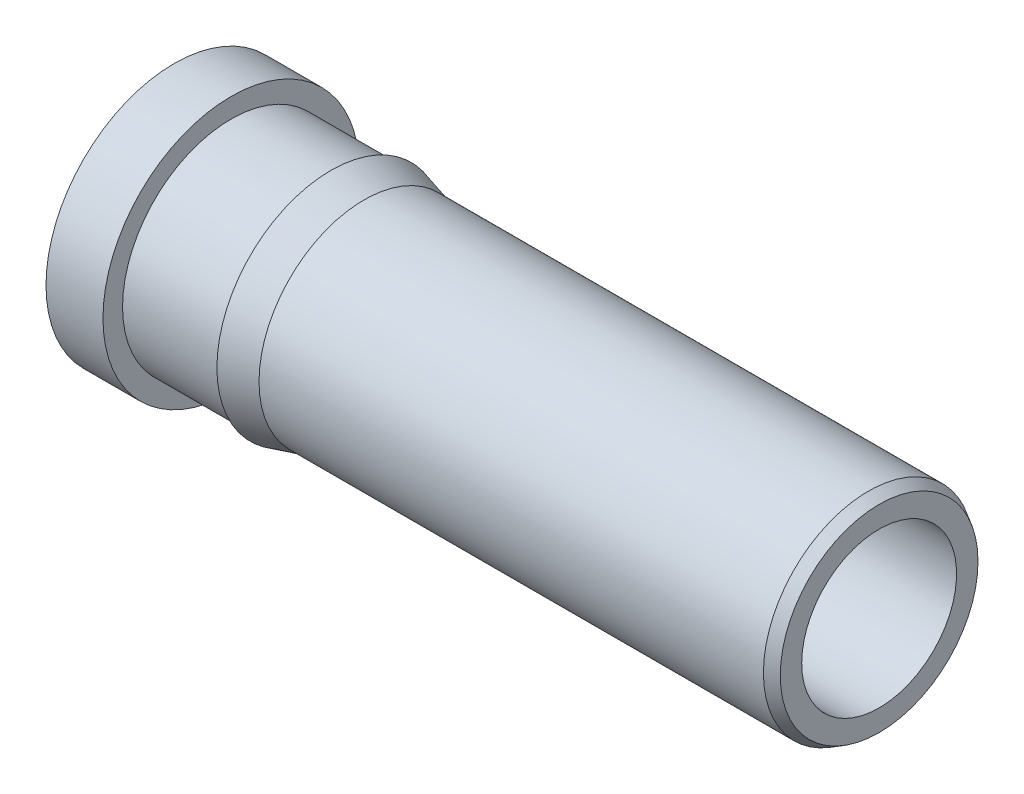
ISO-10303-21;
HEADER;
FILE_DESCRIPTION(('STEP AP214'),'2;1');
FILE_NAME('part.step','',(''),(''),'','','');
FILE_SCHEMA(('AUTOMOTIVE_DESIGN { 1 0 10303 214 1 1 1 1 }'));
ENDSEC;
DATA;
#1=APPLICATION_CONTEXT('core data for automotive mechanical design processes');
#2=APPLICATION_PROTOCOL_DEFINITION('international standard','automotive_design',2000,#1);
#3=PRODUCT_CONTEXT('',#1,'mechanical');
#4=PRODUCT('Part','Part','',(#3));
#5=PRODUCT_RELATED_PRODUCT_CATEGORY('part','',(#4));
#6=PRODUCT_DEFINITION_FORMATION('','',#4);
#7=PRODUCT_DEFINITION_CONTEXT('part definition',#1,'design');
#8=PRODUCT_DEFINITION('design','',#6,#7);
#9=PRODUCT_DEFINITION_SHAPE('','',#8);
#10=(LENGTH_UNIT() NAMED_UNIT(*) SI_UNIT(.MILLI.,.METRE.));
#11=(NAMED_UNIT(*) PLANE_ANGLE_UNIT() SI_UNIT($,.RADIAN.));
#12=(NAMED_UNIT(*) SI_UNIT($,.STERADIAN.) SOLID_ANGLE_UNIT());
#13=UNCERTAINTY_MEASURE_WITH_UNIT(LENGTH_MEASURE(1.E-05),#10,'distance_accuracy_value','');
#14=(GEOMETRIC_REPRESENTATION_CONTEXT(3) GLOBAL_UNCERTAINTY_ASSIGNED_CONTEXT((#13)) GLOBAL_UNIT_ASSIGNED_CONTEXT((#10,
#11,#12)) REPRESENTATION_CONTEXT('',''));
#15=CARTESIAN_POINT('',(0.,0.,0.));
#16=DIRECTION('',(0.,0.,1.));
#17=DIRECTION('',(1.,0.,0.));
#18=AXIS2_PLACEMENT_3D('',#15,#16,#17);
#19=CARTESIAN_POINT('',(5.02920000000003,0.705305909487725,0.));
#20=DIRECTION('',(-1.,0.,0.));
#21=DIRECTION('',(0.,0.,1.));
#22=AXIS2_PLACEMENT_3D('',#19,#20,#21);
#23=PLANE('',#22);
#24=CARTESIAN_POINT('',(5.02920000000004,0.,0.));
#25=DIRECTION('',(-1.,0.,0.));
#26=DIRECTION('',(0.,0.,1.));
#27=AXIS2_PLACEMENT_3D('',#24,#25,#26);
#28=CIRCLE('',#27,0.552449999999999);
#29=CARTESIAN_POINT('',(5.02920000000004,0.,0.552449999999999));
#30=VERTEX_POINT('',#29);
#31=EDGE_CURVE('E68',#30,#30,#28,.T.);
#32=ORIENTED_EDGE('',*,*,#31,.T.);
#33=EDGE_LOOP('',(#32));
#34=FACE_BOUND('',#33,.T.);
#35=CARTESIAN_POINT('',(5.02920000000001,0.,0.));
#36=DIRECTION('',(-1.,0.,0.));
#37=DIRECTION('',(0.,0.,1.));
#38=AXIS2_PLACEMENT_3D('',#35,#36,#37);
#39=CIRCLE('',#38,0.705305909487725);
#40=CARTESIAN_POINT('',(5.02920000000001,0.,0.705305909487725));
#41=VERTEX_POINT('',#40);
#42=EDGE_CURVE('E10',#41,#41,#39,.T.);
#43=ORIENTED_EDGE('',*,*,#42,.F.);
#44=EDGE_LOOP('',(#43));
#45=FACE_BOUND('',#44,.T.);
#46=ADVANCED_FACE('F31',(#34,#45),#23,.F.);
#47=CARTESIAN_POINT('',(5.02920000000001,0.,0.));
#48=DIRECTION('',(-1.,0.,0.));
#49=DIRECTION('',(0.,0.,1.));
#50=AXIS2_PLACEMENT_3D('',#47,#48,#49);
#51=CONICAL_SURFACE('',#50,0.705305909487725,0.523598775598529);
#52=CARTESIAN_POINT('',(4.95300000000004,0.,0.));
#53=DIRECTION('',(-1.,0.,0.));
#54=DIRECTION('',(0.,0.,1.));
#55=AXIS2_PLACEMENT_3D('',#52,#53,#54);
#56=CIRCLE('',#55,0.749299999999981);
#57=CARTESIAN_POINT('',(4.95300000000004,0.,0.749299999999981));
#58=VERTEX_POINT('',#57);
#59=EDGE_CURVE('E38',#58,#58,#56,.T.);
#60=ORIENTED_EDGE('',*,*,#59,.F.);
#61=EDGE_LOOP('',(#60));
#62=FACE_BOUND('',#61,.T.);
#63=ORIENTED_EDGE('',*,*,#42,.T.);
#64=EDGE_LOOP('',(#63));
#65=FACE_BOUND('',#64,.T.);
#66=ADVANCED_FACE('F89',(#62,#65),#51,.T.);
#67=CARTESIAN_POINT('',(0.,0.,0.));
#68=DIRECTION('',(-1.,0.,0.));
#69=DIRECTION('',(0.,0.,1.));
#70=AXIS2_PLACEMENT_3D('',#67,#68,#69);
#71=CYLINDRICAL_SURFACE('',#70,0.749299999999981);
#72=CARTESIAN_POINT('',(1.35458522628059,0.,0.));
#73=DIRECTION('',(-1.,0.,0.));
#74=DIRECTION('',(0.,0.,1.));
#75=AXIS2_PLACEMENT_3D('',#72,#73,#74);
#76=CIRCLE('',#75,0.749299999999981);
#77=CARTESIAN_POINT('',(1.35458522628059,0.,0.749299999999981));
#78=VERTEX_POINT('',#77);
#79=EDGE_CURVE('E42',#78,#78,#76,.T.);
#80=ORIENTED_EDGE('',*,*,#79,.F.);
#81=EDGE_LOOP('',(#80));
#82=FACE_BOUND('',#81,.T.);
#83=ORIENTED_EDGE('',*,*,#59,.T.);
#84=EDGE_LOOP('',(#83));
#85=FACE_BOUND('',#84,.T.);
#86=ADVANCED_FACE('F93',(#82,#85),#71,.T.);
#87=CARTESIAN_POINT('',(1.35458522628059,0.,0.));
#88=DIRECTION('',(-1.,0.,0.));
#89=DIRECTION('',(0.,0.,1.));
#90=AXIS2_PLACEMENT_3D('',#87,#88,#89);
#91=CONICAL_SURFACE('',#90,0.749299999999981,0.261799387799376);
#92=CARTESIAN_POINT('',(1.1176,0.,0.));
#93=DIRECTION('',(-1.,0.,0.));
#94=DIRECTION('',(0.,0.,1.));
#95=AXIS2_PLACEMENT_3D('',#92,#93,#94);
#96=CIRCLE('',#95,0.81280000000003);
#97=CARTESIAN_POINT('',(1.1176,0.,0.81280000000003));
#98=VERTEX_POINT('',#97);
#99=EDGE_CURVE('E47',#98,#98,#96,.T.);
#100=ORIENTED_EDGE('',*,*,#99,.F.);
#101=EDGE_LOOP('',(#100));
#102=FACE_BOUND('',#101,.T.);
#103=ORIENTED_EDGE('',*,*,#79,.T.);
#104=EDGE_LOOP('',(#103));
#105=FACE_BOUND('',#104,.T.);
#106=ADVANCED_FACE('F99',(#102,#105),#91,.T.);
#107=CARTESIAN_POINT('',(1.1176,0.774699999999989,0.));
#108=DIRECTION('',(1.,0.,0.));
#109=DIRECTION('',(0.,0.,-1.));
#110=AXIS2_PLACEMENT_3D('',#107,#108,#109);
#111=PLANE('',#110);
#112=CARTESIAN_POINT('',(1.1176,0.,0.));
#113=DIRECTION('',(-1.,0.,0.));
#114=DIRECTION('',(0.,0.,1.));
#115=AXIS2_PLACEMENT_3D('',#112,#113,#114);
#116=CIRCLE('',#115,0.774699999999989);
#117=CARTESIAN_POINT('',(1.1176,0.,0.774699999999989));
#118=VERTEX_POINT('',#117);
#119=EDGE_CURVE('E50',#118,#118,#116,.T.);
#120=ORIENTED_EDGE('',*,*,#119,.F.);
#121=EDGE_LOOP('',(#120));
#122=FACE_BOUND('',#121,.T.);
#123=ORIENTED_EDGE('',*,*,#99,.T.);
#124=EDGE_LOOP('',(#123));
#125=FACE_BOUND('',#124,.T.);
#126=ADVANCED_FACE('F106',(#122,#125),#111,.F.);
#127=CARTESIAN_POINT('',(0.,0.,0.));
#128=DIRECTION('',(-1.,0.,0.));
#129=DIRECTION('',(0.,0.,1.));
#130=AXIS2_PLACEMENT_3D('',#127,#128,#129);
#131=CYLINDRICAL_SURFACE('',#130,0.774699999999989);
#132=CARTESIAN_POINT('',(0.406400000000029,0.,0.));
#133=DIRECTION('',(-1.,0.,0.));
#134=DIRECTION('',(0.,0.,1.));
#135=AXIS2_PLACEMENT_3D('',#132,#133,#134);
#136=CIRCLE('',#135,0.774699999999989);
#137=CARTESIAN_POINT('',(0.406400000000029,0.,0.774699999999989));
#138=VERTEX_POINT('',#137);
#139=EDGE_CURVE('E53',#138,#138,#136,.T.);
#140=ORIENTED_EDGE('',*,*,#139,.F.);
#141=EDGE_LOOP('',(#140));
#142=FACE_BOUND('',#141,.T.);
#143=ORIENTED_EDGE('',*,*,#119,.T.);
#144=EDGE_LOOP('',(#143));
#145=FACE_BOUND('',#144,.T.);
#146=ADVANCED_FACE('F110',(#142,#145),#131,.T.);
#147=CARTESIAN_POINT('',(0.406400000000029,0.914399999999982,0.));
#148=DIRECTION('',(-1.,0.,0.));
#149=DIRECTION('',(0.,0.,1.));
#150=AXIS2_PLACEMENT_3D('',#147,#148,#149);
#151=PLANE('',#150);
#152=CARTESIAN_POINT('',(0.406400000000029,0.,0.));
#153=DIRECTION('',(-1.,0.,0.));
#154=DIRECTION('',(0.,0.,1.));
#155=AXIS2_PLACEMENT_3D('',#152,#153,#154);
#156=CIRCLE('',#155,0.914399999999982);
#157=CARTESIAN_POINT('',(0.406400000000029,0.,0.914399999999982));
#158=VERTEX_POINT('',#157);
#159=EDGE_CURVE('E56',#158,#158,#156,.T.);
#160=ORIENTED_EDGE('',*,*,#159,.F.);
#161=EDGE_LOOP('',(#160));
#162=FACE_BOUND('',#161,.T.);
#163=ORIENTED_EDGE('',*,*,#139,.T.);
#164=EDGE_LOOP('',(#163));
#165=FACE_BOUND('',#164,.T.);
#166=ADVANCED_FACE('F114',(#162,#165),#151,.F.);
#167=CARTESIAN_POINT('',(0.,0.,0.));
#168=DIRECTION('',(-1.,0.,0.));
#169=DIRECTION('',(0.,0.,1.));
#170=AXIS2_PLACEMENT_3D('',#167,#168,#169);
#171=CYLINDRICAL_SURFACE('',#170,0.914399999999982);
#172=CARTESIAN_POINT('',(0.,0.,0.));
#173=DIRECTION('',(-1.,0.,0.));
#174=DIRECTION('',(0.,0.,1.));
#175=AXIS2_PLACEMENT_3D('',#172,#173,#174);
#176=CIRCLE('',#175,0.914399999999982);
#177=CARTESIAN_POINT('',(0.,0.,0.914399999999982));
#178=VERTEX_POINT('',#177);
#179=EDGE_CURVE('E59',#178,#178,#176,.T.);
#180=ORIENTED_EDGE('',*,*,#179,.F.);
#181=EDGE_LOOP('',(#180));
#182=FACE_BOUND('',#181,.T.);
#183=ORIENTED_EDGE('',*,*,#159,.T.);
#184=EDGE_LOOP('',(#183));
#185=FACE_BOUND('',#184,.T.);
#186=ADVANCED_FACE('F118',(#182,#185),#171,.T.);
#187=CARTESIAN_POINT('',(0.,0.,0.));
#188=DIRECTION('',(1.,0.,0.));
#189=DIRECTION('',(0.,0.,-1.));
#190=AXIS2_PLACEMENT_3D('',#187,#188,#189);
#191=PLANE('',#190);
#192=CARTESIAN_POINT('',(0.,0.,0.));
#193=DIRECTION('',(-1.,0.,0.));
#194=DIRECTION('',(0.,0.,1.));
#195=AXIS2_PLACEMENT_3D('',#192,#193,#194);
#196=CIRCLE('',#195,0.647699999999999);
#197=CARTESIAN_POINT('',(0.,0.,0.647699999999999));
#198=VERTEX_POINT('',#197);
#199=EDGE_CURVE('E65',#198,#198,#196,.T.);
#200=ORIENTED_EDGE('',*,*,#199,.F.);
#201=EDGE_LOOP('',(#200));
#202=FACE_BOUND('',#201,.T.);
#203=ORIENTED_EDGE('',*,*,#179,.T.);
#204=EDGE_LOOP('',(#203));
#205=FACE_BOUND('',#204,.T.);
#206=ADVANCED_FACE('F122',(#202,#205),#191,.F.);
#207=CARTESIAN_POINT('',(3.1496,0.,0.));
#208=DIRECTION('',(-1.,0.,0.));
#209=DIRECTION('',(0.,0.,1.));
#210=AXIS2_PLACEMENT_3D('',#207,#208,#209);
#211=CONICAL_SURFACE('',#210,0.647699999999999,1.02974425867666);
#212=CARTESIAN_POINT('',(3.20683197396238,0.,0.));
#213=DIRECTION('',(-1.,0.,0.));
#214=DIRECTION('',(0.,0.,1.));
#215=AXIS2_PLACEMENT_3D('',#212,#213,#214);
#216=CIRCLE('',#215,0.552449999999999);
#217=CARTESIAN_POINT('',(3.20683197396238,0.,0.552449999999999));
#218=VERTEX_POINT('',#217);
#219=EDGE_CURVE('E34',#218,#218,#216,.F.);
#220=ORIENTED_EDGE('',*,*,#219,.T.);
#221=EDGE_LOOP('',(#220));
#222=FACE_BOUND('',#221,.T.);
#223=CARTESIAN_POINT('',(3.1496,0.,0.));
#224=DIRECTION('',(-1.,0.,0.));
#225=DIRECTION('',(0.,0.,1.));
#226=AXIS2_PLACEMENT_3D('',#223,#224,#225);
#227=CIRCLE('',#226,0.647699999999999);
#228=CARTESIAN_POINT('',(3.1496,0.,0.647699999999999));
#229=VERTEX_POINT('',#228);
#230=EDGE_CURVE('E62',#229,#229,#227,.T.);
#231=ORIENTED_EDGE('',*,*,#230,.T.);
#232=EDGE_LOOP('',(#231));
#233=FACE_BOUND('',#232,.T.);
#234=ADVANCED_FACE('F75',(#222,#233),#211,.F.);
#235=CARTESIAN_POINT('',(0.,0.,0.));
#236=DIRECTION('',(-1.,0.,0.));
#237=DIRECTION('',(0.,0.,1.));
#238=AXIS2_PLACEMENT_3D('',#235,#236,#237);
#239=CYLINDRICAL_SURFACE('',#238,0.647699999999999);
#240=ORIENTED_EDGE('',*,*,#230,.F.);
#241=EDGE_LOOP('',(#240));
#242=FACE_BOUND('',#241,.T.);
#243=ORIENTED_EDGE('',*,*,#199,.T.);
#244=EDGE_LOOP('',(#243));
#245=FACE_BOUND('',#244,.T.);
#246=ADVANCED_FACE('F80',(#242,#245),#239,.F.);
#247=CARTESIAN_POINT('',(0.,0.,0.));
#248=DIRECTION('',(-1.,0.,0.));
#249=DIRECTION('',(0.,0.,1.));
#250=AXIS2_PLACEMENT_3D('',#247,#248,#249);
#251=CYLINDRICAL_SURFACE('',#250,0.552449999999999);
#252=ORIENTED_EDGE('',*,*,#31,.F.);
#253=EDGE_LOOP('',(#252));
#254=FACE_BOUND('',#253,.T.);
#255=ORIENTED_EDGE('',*,*,#219,.F.);
#256=EDGE_LOOP('',(#255));
#257=FACE_BOUND('',#256,.T.);
#258=ADVANCED_FACE('F78',(#254,#257),#251,.F.);
#259=CLOSED_SHELL('',(#46,#66,#86,#106,#126,#146,#166,#186,#206,#234,#246,#258));
#260=MANIFOLD_SOLID_BREP('B2',#259);
#261=ADVANCED_BREP_SHAPE_REPRESENTATION('',(#18,#260),#14);
#262=SHAPE_DEFINITION_REPRESENTATION(#9,#261);
ENDSEC;
END-ISO-10303-21;
